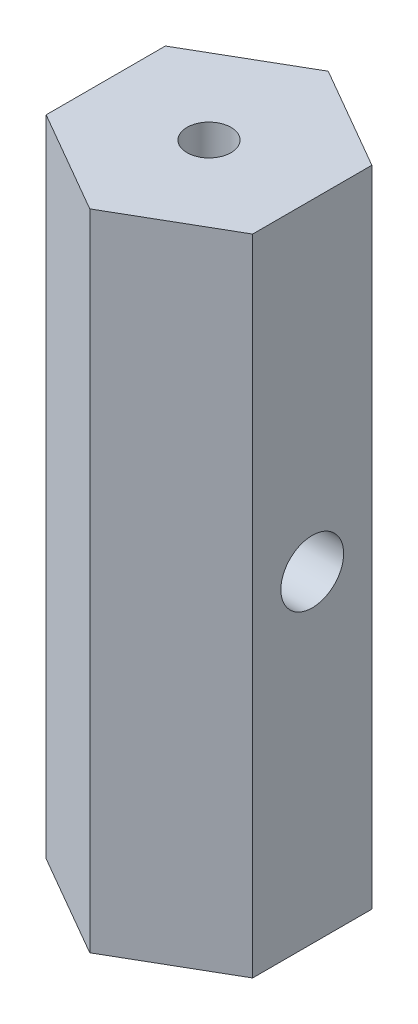
ISO-10303-21;
HEADER;
FILE_DESCRIPTION(('STEP AP214'),'2;1');
FILE_NAME('part.step','',(''),(''),'','','');
FILE_SCHEMA(('AUTOMOTIVE_DESIGN { 1 0 10303 214 1 1 1 1 }'));
ENDSEC;
DATA;
#1=APPLICATION_CONTEXT('core data for automotive mechanical design processes');
#2=APPLICATION_PROTOCOL_DEFINITION('international standard','automotive_design',2000,#1);
#3=PRODUCT_CONTEXT('',#1,'mechanical');
#4=PRODUCT('Part','Part','',(#3));
#5=PRODUCT_RELATED_PRODUCT_CATEGORY('part','',(#4));
#6=PRODUCT_DEFINITION_FORMATION('','',#4);
#7=PRODUCT_DEFINITION_CONTEXT('part definition',#1,'design');
#8=PRODUCT_DEFINITION('design','',#6,#7);
#9=PRODUCT_DEFINITION_SHAPE('','',#8);
#10=(LENGTH_UNIT() NAMED_UNIT(*) SI_UNIT(.MILLI.,.METRE.));
#11=(NAMED_UNIT(*) PLANE_ANGLE_UNIT() SI_UNIT($,.RADIAN.));
#12=(NAMED_UNIT(*) SI_UNIT($,.STERADIAN.) SOLID_ANGLE_UNIT());
#13=UNCERTAINTY_MEASURE_WITH_UNIT(LENGTH_MEASURE(1.E-05),#10,'distance_accuracy_value','');
#14=(GEOMETRIC_REPRESENTATION_CONTEXT(3) GLOBAL_UNCERTAINTY_ASSIGNED_CONTEXT((#13)) GLOBAL_UNIT_ASSIGNED_CONTEXT((#10,
#11,#12)) REPRESENTATION_CONTEXT('',''));
#15=CARTESIAN_POINT('',(0.,0.,0.));
#16=DIRECTION('',(0.,0.,1.));
#17=DIRECTION('',(1.,0.,0.));
#18=AXIS2_PLACEMENT_3D('',#15,#16,#17);
#19=CARTESIAN_POINT('',(6.35,19.812,-3.66617420935414));
#20=DIRECTION('',(-1.,0.,0.));
#21=DIRECTION('',(0.,0.,1.));
#22=AXIS2_PLACEMENT_3D('',#19,#20,#21);
#23=PLANE('',#22);
#24=DIRECTION('',(0.,-1.,0.));
#25=VECTOR('',#24,1.);
#26=CARTESIAN_POINT('',(6.35,19.812,3.6661742093541));
#27=LINE('',#26,#25);
#28=CARTESIAN_POINT('',(6.35,19.812,3.6661742093541));
#29=VERTEX_POINT('',#28);
#30=CARTESIAN_POINT('',(6.35,-19.812,3.6661742093541));
#31=VERTEX_POINT('',#30);
#32=EDGE_CURVE('E431',#29,#31,#27,.T.);
#33=ORIENTED_EDGE('',*,*,#32,.T.);
#34=DIRECTION('',(0.,0.,-1.));
#35=VECTOR('',#34,1.);
#36=CARTESIAN_POINT('',(6.35,-19.812,-3.66617420935414));
#37=LINE('',#36,#35);
#38=CARTESIAN_POINT('',(6.35,-19.812,-3.66617420935414));
#39=VERTEX_POINT('',#38);
#40=EDGE_CURVE('E424',#31,#39,#37,.T.);
#41=ORIENTED_EDGE('',*,*,#40,.T.);
#42=DIRECTION('',(0.,-1.,0.));
#43=VECTOR('',#42,1.);
#44=CARTESIAN_POINT('',(6.35,19.812,-3.66617420935414));
#45=LINE('',#44,#43);
#46=CARTESIAN_POINT('',(6.35,19.812,-3.66617420935414));
#47=VERTEX_POINT('',#46);
#48=EDGE_CURVE('E11',#47,#39,#45,.T.);
#49=ORIENTED_EDGE('',*,*,#48,.F.);
#50=DIRECTION('',(0.,0.,-1.));
#51=VECTOR('',#50,1.);
#52=CARTESIAN_POINT('',(6.35,19.812,-3.66617420935414));
#53=LINE('',#52,#51);
#54=EDGE_CURVE('E451',#29,#47,#53,.T.);
#55=ORIENTED_EDGE('',*,*,#54,.F.);
#56=EDGE_LOOP('',(#33,#41,#49,#55));
#57=FACE_BOUND('',#56,.T.);
#58=CARTESIAN_POINT('',(6.35,0.,0.));
#59=DIRECTION('',(-1.,0.,0.));
#60=DIRECTION('',(0.,0.,1.));
#61=AXIS2_PLACEMENT_3D('',#58,#59,#60);
#62=CIRCLE('',#61,1.9304);
#63=CARTESIAN_POINT('',(6.35,0.,1.9304));
#64=VERTEX_POINT('',#63);
#65=EDGE_CURVE('E435',#64,#64,#62,.T.);
#66=ORIENTED_EDGE('',*,*,#65,.T.);
#67=EDGE_LOOP('',(#66));
#68=FACE_BOUND('',#67,.T.);
#69=ADVANCED_FACE('F360',(#57,#68),#23,.F.);
#70=CARTESIAN_POINT('',(-6.35,19.812,3.66617420935413));
#71=DIRECTION('',(1.,0.,0.));
#72=DIRECTION('',(0.,0.,-1.));
#73=AXIS2_PLACEMENT_3D('',#70,#71,#72);
#74=PLANE('',#73);
#75=DIRECTION('',(0.,-1.,0.));
#76=VECTOR('',#75,1.);
#77=CARTESIAN_POINT('',(-6.35,19.812,-3.6661742093541));
#78=LINE('',#77,#76);
#79=CARTESIAN_POINT('',(-6.35,19.812,-3.6661742093541));
#80=VERTEX_POINT('',#79);
#81=CARTESIAN_POINT('',(-6.35,-19.812,-3.6661742093541));
#82=VERTEX_POINT('',#81);
#83=EDGE_CURVE('E465',#80,#82,#78,.T.);
#84=ORIENTED_EDGE('',*,*,#83,.T.);
#85=DIRECTION('',(0.,0.,1.));
#86=VECTOR('',#85,1.);
#87=CARTESIAN_POINT('',(-6.35,-19.812,3.66617420935413));
#88=LINE('',#87,#86);
#89=CARTESIAN_POINT('',(-6.35,-19.812,3.66617420935413));
#90=VERTEX_POINT('',#89);
#91=EDGE_CURVE('E440',#82,#90,#88,.T.);
#92=ORIENTED_EDGE('',*,*,#91,.T.);
#93=DIRECTION('',(0.,-1.,0.));
#94=VECTOR('',#93,1.);
#95=CARTESIAN_POINT('',(-6.35,19.812,3.66617420935413));
#96=LINE('',#95,#94);
#97=CARTESIAN_POINT('',(-6.35,19.812,3.66617420935413));
#98=VERTEX_POINT('',#97);
#99=EDGE_CURVE('E463',#98,#90,#96,.T.);
#100=ORIENTED_EDGE('',*,*,#99,.F.);
#101=DIRECTION('',(0.,0.,1.));
#102=VECTOR('',#101,1.);
#103=CARTESIAN_POINT('',(-6.35,19.812,3.66617420935413));
#104=LINE('',#103,#102);
#105=EDGE_CURVE('E456',#80,#98,#104,.T.);
#106=ORIENTED_EDGE('',*,*,#105,.F.);
#107=EDGE_LOOP('',(#84,#92,#100,#106));
#108=FACE_BOUND('',#107,.T.);
#109=CARTESIAN_POINT('',(-6.35,0.,0.));
#110=DIRECTION('',(1.,0.,0.));
#111=DIRECTION('',(0.,0.,-1.));
#112=AXIS2_PLACEMENT_3D('',#109,#110,#111);
#113=CIRCLE('',#112,1.9304);
#114=CARTESIAN_POINT('',(-6.35,0.,-1.9304));
#115=VERTEX_POINT('',#114);
#116=EDGE_CURVE('E538',#115,#115,#113,.F.);
#117=ORIENTED_EDGE('',*,*,#116,.F.);
#118=EDGE_LOOP('',(#117));
#119=FACE_BOUND('',#118,.T.);
#120=ADVANCED_FACE('F475',(#108,#119),#74,.F.);
#121=CARTESIAN_POINT('',(0.,19.812,0.));
#122=DIRECTION('',(0.,-1.,0.));
#123=DIRECTION('',(0.,0.,-1.));
#124=AXIS2_PLACEMENT_3D('',#121,#122,#123);
#125=CYLINDRICAL_SURFACE('',#124,1.35255);
#126=CARTESIAN_POINT('',(0.,19.812,0.));
#127=DIRECTION('',(0.,1.,0.));
#128=DIRECTION('',(0.,0.,1.));
#129=AXIS2_PLACEMENT_3D('',#126,#127,#128);
#130=CIRCLE('',#129,1.35255);
#131=CARTESIAN_POINT('',(0.,19.812,1.35255));
#132=VERTEX_POINT('',#131);
#133=EDGE_CURVE('E448',#132,#132,#130,.T.);
#134=ORIENTED_EDGE('',*,*,#133,.T.);
#135=EDGE_LOOP('',(#134));
#136=FACE_BOUND('',#135,.T.);
#137=CARTESIAN_POINT('',(0.,1.37733534678378,1.35255));
#138=CARTESIAN_POINT('',(0.0648530201230944,1.3773493670669,1.35254243943125));
#139=CARTESIAN_POINT('',(0.129780067415963,1.38201412803462,1.34783546147366));
#140=CARTESIAN_POINT('',(0.257220367390132,1.3997083119165,1.32943867824006));
#141=CARTESIAN_POINT('',(0.319726798695202,1.41275977426448,1.3157252026653));
#142=CARTESIAN_POINT('',(0.440004051467046,1.444756877397,1.28049810005175));
#143=CARTESIAN_POINT('',(0.497820185354885,1.46363465387409,1.25907383318285));
#144=CARTESIAN_POINT('',(0.608900886604142,1.50504218280734,1.20927267395562));
#145=CARTESIAN_POINT('',(0.662165232520626,1.52757211278684,1.18089544359436));
#146=CARTESIAN_POINT('',(0.77287154796563,1.5784666998126,1.11221297911975));
#147=CARTESIAN_POINT('',(0.829405401996451,1.60716131922975,1.07068830685041));
#148=CARTESIAN_POINT('',(0.935513590952789,1.66440553656818,0.979342659839463));
#149=CARTESIAN_POINT('',(0.985079291530672,1.69295491304685,0.929511556617716));
#150=CARTESIAN_POINT('',(1.08409066113262,1.75227909781525,0.812969463626391));
#151=CARTESIAN_POINT('',(1.13213395846953,1.78262934465692,0.74482927260273));
#152=CARTESIAN_POINT('',(1.21561124436246,1.83677919202623,0.598918701424468));
#153=CARTESIAN_POINT('',(1.25107040880123,1.86059184981974,0.521167973402441));
#154=CARTESIAN_POINT('',(1.29951310617903,1.8935595210145,0.380288016910429));
#155=CARTESIAN_POINT('',(1.31597856596714,1.90493533273098,0.318866584212294));
#156=CARTESIAN_POINT('',(1.34014765452286,1.92171034368025,0.193539042561926));
#157=CARTESIAN_POINT('',(1.34785831940531,1.9271143422881,0.129634971657513));
#158=CARTESIAN_POINT('',(1.35408398534359,1.93147385140685,0.00103181692961999));
#159=CARTESIAN_POINT('',(1.35258105852806,1.93041678995358,-0.0636685722211663));
#160=CARTESIAN_POINT('',(1.34043050510259,1.92192300713964,-0.19178148043198));
#161=CARTESIAN_POINT('',(1.32978028818574,1.91448447869167,-0.255193629484147));
#162=CARTESIAN_POINT('',(1.30027959112502,1.89411440980424,-0.377540892878191));
#163=CARTESIAN_POINT('',(1.2816230001869,1.88131290806232,-0.436545370906456));
#164=CARTESIAN_POINT('',(1.2369860508601,1.85119324493214,-0.550457394819342));
#165=CARTESIAN_POINT('',(1.21100432750098,1.83387424179446,-0.605364174722015));
#166=CARTESIAN_POINT('',(1.14930157000408,1.79369352514085,-0.716213633852722));
#167=CARTESIAN_POINT('',(1.11281481729921,1.77042792548807,-0.771581190717357));
#168=CARTESIAN_POINT('',(1.03284657381608,1.72128704500897,-0.875750961197346));
#169=CARTESIAN_POINT('',(0.989357494532009,1.69540894446291,-0.924545945466577));
#170=CARTESIAN_POINT('',(0.887783223398761,1.63803025134626,-1.02328508213962));
#171=CARTESIAN_POINT('',(0.828478559465468,1.60635163263059,-1.07187490540144));
#172=CARTESIAN_POINT('',(0.701831877518403,1.54484824419096,-1.15875639030497));
#173=CARTESIAN_POINT('',(0.634490860552309,1.51502324427353,-1.19704933264764));
#174=CARTESIAN_POINT('',(0.508748072352289,1.4674206328911,-1.25466382566595));
#175=CARTESIAN_POINT('',(0.451873463016482,1.44845146846668,-1.27632434545355));
#176=CARTESIAN_POINT('',(0.334312686839316,1.41621240415852,-1.3120105417583));
#177=CARTESIAN_POINT('',(0.273638947361314,1.4029249317858,-1.32605979512635));
#178=CARTESIAN_POINT('',(0.176989245101606,1.38823352162447,-1.34138282780334));
#179=CARTESIAN_POINT('',(0.141854397787233,1.38417356213129,-1.34555730345349));
#180=CARTESIAN_POINT('',(0.0711538419268254,1.37872041888116,-1.3511431805462));
#181=CARTESIAN_POINT('',(0.0355880667194112,1.37732765315949,-1.35255414885883));
#182=CARTESIAN_POINT('',(-0.0648530201230945,1.3773493670669,-1.35254243943125));
#183=CARTESIAN_POINT('',(-0.129780067415963,1.38201412803462,-1.34783546147366));
#184=CARTESIAN_POINT('',(-0.257220367390132,1.3997083119165,-1.32943867824006));
#185=CARTESIAN_POINT('',(-0.319726798695201,1.41275977426448,-1.3157252026653));
#186=CARTESIAN_POINT('',(-0.440004051467046,1.444756877397,-1.28049810005175));
#187=CARTESIAN_POINT('',(-0.497820185354885,1.46363465387409,-1.25907383318285));
#188=CARTESIAN_POINT('',(-0.608900886604141,1.50504218280734,-1.20927267395562));
#189=CARTESIAN_POINT('',(-0.662165232520626,1.52757211278684,-1.18089544359436));
#190=CARTESIAN_POINT('',(-0.772871547965629,1.5784666998126,-1.11221297911975));
#191=CARTESIAN_POINT('',(-0.82940540199645,1.60716131922975,-1.07068830685041));
#192=CARTESIAN_POINT('',(-0.935513590952789,1.66440553656818,-0.979342659839463));
#193=CARTESIAN_POINT('',(-0.985079291530671,1.69295491304685,-0.929511556617716));
#194=CARTESIAN_POINT('',(-1.08409066113262,1.75227909781525,-0.812969463626391));
#195=CARTESIAN_POINT('',(-1.13213395846953,1.78262934465692,-0.74482927260273));
#196=CARTESIAN_POINT('',(-1.21561124436246,1.83677919202623,-0.598918701424468));
#197=CARTESIAN_POINT('',(-1.25107040880123,1.86059184981974,-0.521167973402441));
#198=CARTESIAN_POINT('',(-1.29951310617903,1.8935595210145,-0.380288016910429));
#199=CARTESIAN_POINT('',(-1.31597856596714,1.90493533273098,-0.318866584212295));
#200=CARTESIAN_POINT('',(-1.34014765452286,1.92171034368025,-0.193539042561927));
#201=CARTESIAN_POINT('',(-1.34785831940531,1.9271143422881,-0.129634971657513));
#202=CARTESIAN_POINT('',(-1.35408398534359,1.93147385140685,-0.00103181692962011));
#203=CARTESIAN_POINT('',(-1.35258105852806,1.93041678995358,0.063668572221166));
#204=CARTESIAN_POINT('',(-1.34043050510259,1.92192300713964,0.19178148043198));
#205=CARTESIAN_POINT('',(-1.32978028818574,1.91448447869167,0.255193629484147));
#206=CARTESIAN_POINT('',(-1.30027959112502,1.89411440980424,0.377540892878191));
#207=CARTESIAN_POINT('',(-1.2816230001869,1.88131290806232,0.436545370906456));
#208=CARTESIAN_POINT('',(-1.2369860508601,1.85119324493214,0.550457394819342));
#209=CARTESIAN_POINT('',(-1.21100432750098,1.83387424179446,0.605364174722015));
#210=CARTESIAN_POINT('',(-1.14930157000408,1.79369352514085,0.716213633852721));
#211=CARTESIAN_POINT('',(-1.11281481729921,1.77042792548807,0.771581190717357));
#212=CARTESIAN_POINT('',(-1.03284657381609,1.72128704500897,0.875750961197346));
#213=CARTESIAN_POINT('',(-0.989357494532009,1.69540894446291,0.924545945466577));
#214=CARTESIAN_POINT('',(-0.887783223398761,1.63803025134626,1.02328508213962));
#215=CARTESIAN_POINT('',(-0.828478559465468,1.60635163263059,1.07187490540144));
#216=CARTESIAN_POINT('',(-0.701831877518403,1.54484824419096,1.15875639030497));
#217=CARTESIAN_POINT('',(-0.634490860552309,1.51502324427353,1.19704933264764));
#218=CARTESIAN_POINT('',(-0.508748072352289,1.4674206328911,1.25466382566595));
#219=CARTESIAN_POINT('',(-0.451873463016483,1.44845146846668,1.27632434545355));
#220=CARTESIAN_POINT('',(-0.334312686839317,1.41621240415852,1.3120105417583));
#221=CARTESIAN_POINT('',(-0.273638947361314,1.40292493178579,1.32605979512635));
#222=CARTESIAN_POINT('',(-0.176989245101606,1.38823352162447,1.34138282780334));
#223=CARTESIAN_POINT('',(-0.141854397787233,1.38417356213129,1.34555730345349));
#224=CARTESIAN_POINT('',(-0.0711538419268252,1.37872041888116,1.3511431805462));
#225=CARTESIAN_POINT('',(-0.0355880667194111,1.37732765315949,1.35255414885883));
#226=CARTESIAN_POINT('',(0.,1.37733534678378,1.35255));
#227=B_SPLINE_CURVE_WITH_KNOTS('',3,(#137,#138,#139,#140,#141,#142,#143,#144,#145,#146,#147,
#148,#149,#150,#151,#152,#153,#154,#155,#156,#157,#158,#159,#160,#161,#162,#163,#164,#165,#166,
#167,#168,#169,#170,#171,#172,#173,#174,#175,#176,#177,#178,#179,#180,#181,#182,#183,#184,#185,
#186,#187,#188,#189,#190,#191,#192,#193,#194,#195,#196,#197,#198,#199,#200,#201,#202,#203,#204,
#205,#206,#207,#208,#209,#210,#211,#212,#213,#214,#215,#216,#217,#218,#219,#220,#221,#222,#223,
#224,#225,#226),.UNSPECIFIED.,.T.,.F.,(4,2,2,2,2,2,2,2,2,2,2,2,2,2,2,2,2,2,2,2,2,2,2,2,2,2,2,2,
2,2,2,2,2,2,2,2,2,2,2,2,2,2,2,2,4),(0.,0.19438548219122,0.389283891215313,0.581992749258649,
0.774710977275919,1.00126098615992,1.22808928801112,1.49279776111969,1.75697363140646,
1.94994214846621,2.14275546921798,2.33594408640785,2.52918742831489,2.71799397477596,
2.90683572686442,3.11686782595426,3.3271290905984,3.57498316124378,3.82280639012956,
4.01339649790976,4.20339280337691,4.31004503810804,4.4167139873162,4.61109946950742,
4.80599787853152,4.99870673657485,5.19142496459212,5.41797497347612,5.64480327532732,
5.90951174843589,6.17368761872267,6.36665613578241,6.55946945653418,6.75265807372405,
6.94590141563109,7.13470796209216,7.32354971418062,7.53358181327046,7.7438430779146,
7.99169714855998,8.23952037744576,8.43011048522597,8.62010679069311,8.72675902542425,
8.83342797463241),.UNSPECIFIED.);
#228=CARTESIAN_POINT('',(0.,1.37733534678378,1.35255));
#229=VERTEX_POINT('',#228);
#230=EDGE_CURVE('E523',#229,#229,#227,.T.);
#231=ORIENTED_EDGE('',*,*,#230,.F.);
#232=EDGE_LOOP('',(#231));
#233=FACE_BOUND('',#232,.T.);
#234=ADVANCED_FACE('F497',(#136,#233),#125,.F.);
#235=CARTESIAN_POINT('',(0.,-19.812,0.));
#236=DIRECTION('',(0.,1.,0.));
#237=DIRECTION('',(0.,0.,1.));
#238=AXIS2_PLACEMENT_3D('',#235,#236,#237);
#239=CIRCLE('',#238,1.35255);
#240=CARTESIAN_POINT('',(0.,-19.812,1.35255));
#241=VERTEX_POINT('',#240);
#242=EDGE_CURVE('E432',#241,#241,#239,.T.);
#243=ORIENTED_EDGE('',*,*,#242,.F.);
#244=EDGE_LOOP('',(#243));
#245=FACE_BOUND('',#244,.T.);
#246=CARTESIAN_POINT('',(0.,-1.37733534678378,-1.35255));
#247=CARTESIAN_POINT('',(0.0648530201230944,-1.3773493670669,-1.35254243943125));
#248=CARTESIAN_POINT('',(0.129780067415963,-1.38201412803462,-1.34783546147366));
#249=CARTESIAN_POINT('',(0.257220367390132,-1.3997083119165,-1.32943867824006));
#250=CARTESIAN_POINT('',(0.319726798695202,-1.41275977426448,-1.3157252026653));
#251=CARTESIAN_POINT('',(0.440004051467046,-1.444756877397,-1.28049810005175));
#252=CARTESIAN_POINT('',(0.497820185354885,-1.46363465387409,-1.25907383318285));
#253=CARTESIAN_POINT('',(0.608900886604142,-1.50504218280734,-1.20927267395562));
#254=CARTESIAN_POINT('',(0.662165232520626,-1.52757211278684,-1.18089544359436));
#255=CARTESIAN_POINT('',(0.77287154796563,-1.5784666998126,-1.11221297911975));
#256=CARTESIAN_POINT('',(0.829405401996451,-1.60716131922975,-1.07068830685041));
#257=CARTESIAN_POINT('',(0.935513590952789,-1.66440553656818,-0.979342659839463));
#258=CARTESIAN_POINT('',(0.985079291530672,-1.69295491304685,-0.929511556617716));
#259=CARTESIAN_POINT('',(1.08409066113262,-1.75227909781525,-0.812969463626391));
#260=CARTESIAN_POINT('',(1.13213395846953,-1.78262934465692,-0.74482927260273));
#261=CARTESIAN_POINT('',(1.21561124436246,-1.83677919202623,-0.598918701424468));
#262=CARTESIAN_POINT('',(1.25107040880123,-1.86059184981974,-0.521167973402441));
#263=CARTESIAN_POINT('',(1.29951310617903,-1.8935595210145,-0.380288016910429));
#264=CARTESIAN_POINT('',(1.31597856596714,-1.90493533273098,-0.318866584212294));
#265=CARTESIAN_POINT('',(1.34014765452286,-1.92171034368025,-0.193539042561926));
#266=CARTESIAN_POINT('',(1.34785831940531,-1.9271143422881,-0.129634971657513));
#267=CARTESIAN_POINT('',(1.35408398534359,-1.93147385140685,-0.00103181692961999));
#268=CARTESIAN_POINT('',(1.35258105852806,-1.93041678995358,0.0636685722211663));
#269=CARTESIAN_POINT('',(1.34043050510259,-1.92192300713964,0.19178148043198));
#270=CARTESIAN_POINT('',(1.32978028818574,-1.91448447869167,0.255193629484147));
#271=CARTESIAN_POINT('',(1.30027959112502,-1.89411440980424,0.377540892878191));
#272=CARTESIAN_POINT('',(1.2816230001869,-1.88131290806232,0.436545370906456));
#273=CARTESIAN_POINT('',(1.2369860508601,-1.85119324493214,0.550457394819342));
#274=CARTESIAN_POINT('',(1.21100432750098,-1.83387424179446,0.605364174722015));
#275=CARTESIAN_POINT('',(1.14930157000408,-1.79369352514085,0.716213633852722));
#276=CARTESIAN_POINT('',(1.11281481729921,-1.77042792548807,0.771581190717357));
#277=CARTESIAN_POINT('',(1.03284657381608,-1.72128704500897,0.875750961197346));
#278=CARTESIAN_POINT('',(0.989357494532009,-1.69540894446291,0.924545945466577));
#279=CARTESIAN_POINT('',(0.887783223398761,-1.63803025134626,1.02328508213962));
#280=CARTESIAN_POINT('',(0.828478559465468,-1.60635163263059,1.07187490540144));
#281=CARTESIAN_POINT('',(0.701831877518403,-1.54484824419096,1.15875639030497));
#282=CARTESIAN_POINT('',(0.634490860552309,-1.51502324427353,1.19704933264764));
#283=CARTESIAN_POINT('',(0.508748072352289,-1.4674206328911,1.25466382566595));
#284=CARTESIAN_POINT('',(0.451873463016482,-1.44845146846668,1.27632434545355));
#285=CARTESIAN_POINT('',(0.334312686839316,-1.41621240415852,1.3120105417583));
#286=CARTESIAN_POINT('',(0.273638947361314,-1.4029249317858,1.32605979512635));
#287=CARTESIAN_POINT('',(0.176989245101606,-1.38823352162447,1.34138282780334));
#288=CARTESIAN_POINT('',(0.141854397787233,-1.38417356213129,1.34555730345349));
#289=CARTESIAN_POINT('',(0.0711538419268254,-1.37872041888116,1.3511431805462));
#290=CARTESIAN_POINT('',(0.0355880667194112,-1.37732765315949,1.35255414885883));
#291=CARTESIAN_POINT('',(-0.0648530201230945,-1.3773493670669,1.35254243943125));
#292=CARTESIAN_POINT('',(-0.129780067415963,-1.38201412803462,1.34783546147366));
#293=CARTESIAN_POINT('',(-0.257220367390132,-1.3997083119165,1.32943867824006));
#294=CARTESIAN_POINT('',(-0.319726798695201,-1.41275977426448,1.3157252026653));
#295=CARTESIAN_POINT('',(-0.440004051467046,-1.444756877397,1.28049810005175));
#296=CARTESIAN_POINT('',(-0.497820185354885,-1.46363465387409,1.25907383318285));
#297=CARTESIAN_POINT('',(-0.608900886604141,-1.50504218280734,1.20927267395562));
#298=CARTESIAN_POINT('',(-0.662165232520626,-1.52757211278684,1.18089544359436));
#299=CARTESIAN_POINT('',(-0.772871547965629,-1.5784666998126,1.11221297911975));
#300=CARTESIAN_POINT('',(-0.82940540199645,-1.60716131922975,1.07068830685041));
#301=CARTESIAN_POINT('',(-0.935513590952789,-1.66440553656818,0.979342659839463));
#302=CARTESIAN_POINT('',(-0.985079291530671,-1.69295491304685,0.929511556617716));
#303=CARTESIAN_POINT('',(-1.08409066113262,-1.75227909781525,0.812969463626391));
#304=CARTESIAN_POINT('',(-1.13213395846953,-1.78262934465692,0.74482927260273));
#305=CARTESIAN_POINT('',(-1.21561124436246,-1.83677919202623,0.598918701424468));
#306=CARTESIAN_POINT('',(-1.25107040880123,-1.86059184981974,0.521167973402441));
#307=CARTESIAN_POINT('',(-1.29951310617903,-1.8935595210145,0.380288016910429));
#308=CARTESIAN_POINT('',(-1.31597856596714,-1.90493533273098,0.318866584212295));
#309=CARTESIAN_POINT('',(-1.34014765452286,-1.92171034368025,0.193539042561927));
#310=CARTESIAN_POINT('',(-1.34785831940531,-1.9271143422881,0.129634971657513));
#311=CARTESIAN_POINT('',(-1.35408398534359,-1.93147385140685,0.00103181692962011));
#312=CARTESIAN_POINT('',(-1.35258105852806,-1.93041678995358,-0.063668572221166));
#313=CARTESIAN_POINT('',(-1.34043050510259,-1.92192300713964,-0.19178148043198));
#314=CARTESIAN_POINT('',(-1.32978028818574,-1.91448447869167,-0.255193629484147));
#315=CARTESIAN_POINT('',(-1.30027959112502,-1.89411440980424,-0.377540892878191));
#316=CARTESIAN_POINT('',(-1.2816230001869,-1.88131290806232,-0.436545370906456));
#317=CARTESIAN_POINT('',(-1.2369860508601,-1.85119324493214,-0.550457394819342));
#318=CARTESIAN_POINT('',(-1.21100432750098,-1.83387424179446,-0.605364174722015));
#319=CARTESIAN_POINT('',(-1.14930157000408,-1.79369352514085,-0.716213633852721));
#320=CARTESIAN_POINT('',(-1.11281481729921,-1.77042792548807,-0.771581190717357));
#321=CARTESIAN_POINT('',(-1.03284657381609,-1.72128704500897,-0.875750961197346));
#322=CARTESIAN_POINT('',(-0.989357494532009,-1.69540894446291,-0.924545945466577));
#323=CARTESIAN_POINT('',(-0.887783223398761,-1.63803025134626,-1.02328508213962));
#324=CARTESIAN_POINT('',(-0.828478559465468,-1.60635163263059,-1.07187490540144));
#325=CARTESIAN_POINT('',(-0.701831877518403,-1.54484824419096,-1.15875639030497));
#326=CARTESIAN_POINT('',(-0.634490860552309,-1.51502324427353,-1.19704933264764));
#327=CARTESIAN_POINT('',(-0.508748072352289,-1.4674206328911,-1.25466382566595));
#328=CARTESIAN_POINT('',(-0.451873463016483,-1.44845146846668,-1.27632434545355));
#329=CARTESIAN_POINT('',(-0.334312686839317,-1.41621240415852,-1.3120105417583));
#330=CARTESIAN_POINT('',(-0.273638947361314,-1.40292493178579,-1.32605979512635));
#331=CARTESIAN_POINT('',(-0.176989245101606,-1.38823352162447,-1.34138282780334));
#332=CARTESIAN_POINT('',(-0.141854397787233,-1.38417356213129,-1.34555730345349));
#333=CARTESIAN_POINT('',(-0.0711538419268252,-1.37872041888116,-1.3511431805462));
#334=CARTESIAN_POINT('',(-0.0355880667194111,-1.37732765315949,-1.35255414885883));
#335=CARTESIAN_POINT('',(0.,-1.37733534678378,-1.35255));
#336=B_SPLINE_CURVE_WITH_KNOTS('',3,(#246,#247,#248,#249,#250,#251,#252,#253,#254,#255,#256,
#257,#258,#259,#260,#261,#262,#263,#264,#265,#266,#267,#268,#269,#270,#271,#272,#273,#274,#275,
#276,#277,#278,#279,#280,#281,#282,#283,#284,#285,#286,#287,#288,#289,#290,#291,#292,#293,#294,
#295,#296,#297,#298,#299,#300,#301,#302,#303,#304,#305,#306,#307,#308,#309,#310,#311,#312,#313,
#314,#315,#316,#317,#318,#319,#320,#321,#322,#323,#324,#325,#326,#327,#328,#329,#330,#331,#332,
#333,#334,#335),.UNSPECIFIED.,.T.,.F.,(4,2,2,2,2,2,2,2,2,2,2,2,2,2,2,2,2,2,2,2,2,2,2,2,2,2,2,2,
2,2,2,2,2,2,2,2,2,2,2,2,2,2,2,2,4),(0.,0.19438548219122,0.389283891215313,0.581992749258649,
0.774710977275919,1.00126098615992,1.22808928801112,1.49279776111969,1.75697363140646,
1.94994214846621,2.14275546921798,2.33594408640785,2.52918742831489,2.71799397477596,
2.90683572686442,3.11686782595426,3.3271290905984,3.57498316124378,3.82280639012956,
4.01339649790976,4.20339280337691,4.31004503810804,4.4167139873162,4.61109946950742,
4.80599787853152,4.99870673657485,5.19142496459212,5.41797497347612,5.64480327532732,
5.90951174843589,6.17368761872267,6.36665613578241,6.55946945653418,6.75265807372405,
6.94590141563109,7.13470796209216,7.32354971418062,7.53358181327046,7.7438430779146,
7.99169714855998,8.23952037744576,8.43011048522597,8.62010679069311,8.72675902542425,
8.83342797463241),.UNSPECIFIED.);
#337=CARTESIAN_POINT('',(0.,-1.37733534678378,-1.35255));
#338=VERTEX_POINT('',#337);
#339=EDGE_CURVE('E528',#338,#338,#336,.T.);
#340=ORIENTED_EDGE('',*,*,#339,.F.);
#341=EDGE_LOOP('',(#340));
#342=FACE_BOUND('',#341,.T.);
#343=ADVANCED_FACE('F502',(#245,#342),#125,.F.);
#344=CARTESIAN_POINT('',(6.35,19.812,-3.66617420935414));
#345=DIRECTION('',(0.,1.,0.));
#346=DIRECTION('',(0.,0.,1.));
#347=AXIS2_PLACEMENT_3D('',#344,#345,#346);
#348=PLANE('',#347);
#349=ORIENTED_EDGE('',*,*,#54,.T.);
#350=DIRECTION('',(-0.86602540378444,0.,-0.499999999999997));
#351=VECTOR('',#350,1.);
#352=CARTESIAN_POINT('',(0.,19.812,-7.33234841870825));
#353=LINE('',#352,#351);
#354=CARTESIAN_POINT('',(0.,19.812,-7.33234841870825));
#355=VERTEX_POINT('',#354);
#356=EDGE_CURVE('E415',#47,#355,#353,.T.);
#357=ORIENTED_EDGE('',*,*,#356,.T.);
#358=DIRECTION('',(-0.866025403784436,0.,0.500000000000005));
#359=VECTOR('',#358,1.);
#360=CARTESIAN_POINT('',(-6.35,19.812,-3.6661742093541));
#361=LINE('',#360,#359);
#362=EDGE_CURVE('E454',#355,#80,#361,.T.);
#363=ORIENTED_EDGE('',*,*,#362,.T.);
#364=ORIENTED_EDGE('',*,*,#105,.T.);
#365=DIRECTION('',(0.86602540378444,0.,0.499999999999998));
#366=VECTOR('',#365,1.);
#367=CARTESIAN_POINT('',(0.,19.812,7.33234841870825));
#368=LINE('',#367,#366);
#369=CARTESIAN_POINT('',(0.,19.812,7.33234841870825));
#370=VERTEX_POINT('',#369);
#371=EDGE_CURVE('E379',#98,#370,#368,.T.);
#372=ORIENTED_EDGE('',*,*,#371,.T.);
#373=DIRECTION('',(0.866025403784436,0.,-0.500000000000004));
#374=VECTOR('',#373,1.);
#375=CARTESIAN_POINT('',(6.35,19.812,3.6661742093541));
#376=LINE('',#375,#374);
#377=EDGE_CURVE('E374',#370,#29,#376,.T.);
#378=ORIENTED_EDGE('',*,*,#377,.T.);
#379=EDGE_LOOP('',(#349,#357,#363,#364,#372,#378));
#380=FACE_BOUND('',#379,.T.);
#381=ORIENTED_EDGE('',*,*,#133,.F.);
#382=EDGE_LOOP('',(#381));
#383=FACE_BOUND('',#382,.T.);
#384=ADVANCED_FACE('F471',(#380,#383),#348,.T.);
#385=CARTESIAN_POINT('',(0.,19.812,-7.33234841870825));
#386=DIRECTION('',(-0.499999999999997,0.,0.86602540378444));
#387=DIRECTION('',(0.86602540378444,0.,0.499999999999997));
#388=AXIS2_PLACEMENT_3D('',#385,#386,#387);
#389=PLANE('',#388);
#390=ORIENTED_EDGE('',*,*,#48,.T.);
#391=DIRECTION('',(-0.86602540378444,0.,-0.499999999999997));
#392=VECTOR('',#391,1.);
#393=CARTESIAN_POINT('',(0.,-19.812,-7.33234841870825));
#394=LINE('',#393,#392);
#395=CARTESIAN_POINT('',(0.,-19.812,-7.33234841870825));
#396=VERTEX_POINT('',#395);
#397=EDGE_CURVE('E414',#39,#396,#394,.T.);
#398=ORIENTED_EDGE('',*,*,#397,.T.);
#399=DIRECTION('',(0.,-1.,0.));
#400=VECTOR('',#399,1.);
#401=CARTESIAN_POINT('',(0.,19.812,-7.33234841870825));
#402=LINE('',#401,#400);
#403=EDGE_CURVE('E367',#355,#396,#402,.T.);
#404=ORIENTED_EDGE('',*,*,#403,.F.);
#405=ORIENTED_EDGE('',*,*,#356,.F.);
#406=EDGE_LOOP('',(#390,#398,#404,#405));
#407=FACE_BOUND('',#406,.T.);
#408=ADVANCED_FACE('F412',(#407),#389,.F.);
#409=CARTESIAN_POINT('',(-6.35,19.812,-3.6661742093541));
#410=DIRECTION('',(0.500000000000005,0.,0.866025403784436));
#411=DIRECTION('',(0.866025403784436,0.,-0.500000000000005));
#412=AXIS2_PLACEMENT_3D('',#409,#410,#411);
#413=PLANE('',#412);
#414=ORIENTED_EDGE('',*,*,#403,.T.);
#415=DIRECTION('',(-0.866025403784436,0.,0.500000000000005));
#416=VECTOR('',#415,1.);
#417=CARTESIAN_POINT('',(-6.35,-19.812,-3.6661742093541));
#418=LINE('',#417,#416);
#419=EDGE_CURVE('E428',#396,#82,#418,.T.);
#420=ORIENTED_EDGE('',*,*,#419,.T.);
#421=ORIENTED_EDGE('',*,*,#83,.F.);
#422=ORIENTED_EDGE('',*,*,#362,.F.);
#423=EDGE_LOOP('',(#414,#420,#421,#422));
#424=FACE_BOUND('',#423,.T.);
#425=ADVANCED_FACE('F468',(#424),#413,.F.);
#426=CARTESIAN_POINT('',(0.,19.812,7.33234841870825));
#427=DIRECTION('',(0.499999999999998,0.,-0.86602540378444));
#428=DIRECTION('',(-0.86602540378444,0.,-0.499999999999998));
#429=AXIS2_PLACEMENT_3D('',#426,#427,#428);
#430=PLANE('',#429);
#431=ORIENTED_EDGE('',*,*,#99,.T.);
#432=DIRECTION('',(0.86602540378444,0.,0.499999999999998));
#433=VECTOR('',#432,1.);
#434=CARTESIAN_POINT('',(0.,-19.812,7.33234841870825));
#435=LINE('',#434,#433);
#436=CARTESIAN_POINT('',(0.,-19.812,7.33234841870825));
#437=VERTEX_POINT('',#436);
#438=EDGE_CURVE('E443',#90,#437,#435,.T.);
#439=ORIENTED_EDGE('',*,*,#438,.T.);
#440=DIRECTION('',(0.,-1.,0.));
#441=VECTOR('',#440,1.);
#442=CARTESIAN_POINT('',(0.,19.812,7.33234841870825));
#443=LINE('',#442,#441);
#444=EDGE_CURVE('E461',#370,#437,#443,.T.);
#445=ORIENTED_EDGE('',*,*,#444,.F.);
#446=ORIENTED_EDGE('',*,*,#371,.F.);
#447=EDGE_LOOP('',(#431,#439,#445,#446));
#448=FACE_BOUND('',#447,.T.);
#449=ADVANCED_FACE('F479',(#448),#430,.F.);
#450=CARTESIAN_POINT('',(6.35,19.812,3.6661742093541));
#451=DIRECTION('',(-0.500000000000004,0.,-0.866025403784436));
#452=DIRECTION('',(-0.866025403784436,0.,0.500000000000004));
#453=AXIS2_PLACEMENT_3D('',#450,#451,#452);
#454=PLANE('',#453);
#455=ORIENTED_EDGE('',*,*,#444,.T.);
#456=DIRECTION('',(0.866025403784436,0.,-0.500000000000004));
#457=VECTOR('',#456,1.);
#458=CARTESIAN_POINT('',(6.35,-19.812,3.6661742093541));
#459=LINE('',#458,#457);
#460=EDGE_CURVE('E446',#437,#31,#459,.T.);
#461=ORIENTED_EDGE('',*,*,#460,.T.);
#462=ORIENTED_EDGE('',*,*,#32,.F.);
#463=ORIENTED_EDGE('',*,*,#377,.F.);
#464=EDGE_LOOP('',(#455,#461,#462,#463));
#465=FACE_BOUND('',#464,.T.);
#466=ADVANCED_FACE('F481',(#465),#454,.F.);
#467=CARTESIAN_POINT('',(6.35,-19.812,-3.66617420935414));
#468=DIRECTION('',(0.,1.,0.));
#469=DIRECTION('',(0.,0.,1.));
#470=AXIS2_PLACEMENT_3D('',#467,#468,#469);
#471=PLANE('',#470);
#472=ORIENTED_EDGE('',*,*,#242,.T.);
#473=EDGE_LOOP('',(#472));
#474=FACE_BOUND('',#473,.T.);
#475=ORIENTED_EDGE('',*,*,#40,.F.);
#476=ORIENTED_EDGE('',*,*,#460,.F.);
#477=ORIENTED_EDGE('',*,*,#438,.F.);
#478=ORIENTED_EDGE('',*,*,#91,.F.);
#479=ORIENTED_EDGE('',*,*,#419,.F.);
#480=ORIENTED_EDGE('',*,*,#397,.F.);
#481=EDGE_LOOP('',(#475,#476,#477,#478,#479,#480));
#482=FACE_BOUND('',#481,.T.);
#483=ADVANCED_FACE('F422',(#474,#482),#471,.F.);
#484=CARTESIAN_POINT('',(6.351,0.,0.));
#485=DIRECTION('',(-1.,0.,0.));
#486=DIRECTION('',(0.,0.,1.));
#487=AXIS2_PLACEMENT_3D('',#484,#485,#486);
#488=CYLINDRICAL_SURFACE('',#487,1.9304);
#489=ORIENTED_EDGE('',*,*,#339,.T.);
#490=EDGE_LOOP('',(#489));
#491=FACE_BOUND('',#490,.T.);
#492=ORIENTED_EDGE('',*,*,#230,.T.);
#493=EDGE_LOOP('',(#492));
#494=FACE_BOUND('',#493,.T.);
#495=ORIENTED_EDGE('',*,*,#65,.F.);
#496=EDGE_LOOP('',(#495));
#497=FACE_BOUND('',#496,.T.);
#498=ORIENTED_EDGE('',*,*,#116,.T.);
#499=EDGE_LOOP('',(#498));
#500=FACE_BOUND('',#499,.T.);
#501=ADVANCED_FACE('F488',(#491,#494,#497,#500),#488,.F.);
#502=CLOSED_SHELL('',(#69,#120,#234,#343,#384,#408,#425,#449,#466,#483,#501));
#503=MANIFOLD_SOLID_BREP('B2',#502);
#504=ADVANCED_BREP_SHAPE_REPRESENTATION('',(#18,#503),#14);
#505=SHAPE_DEFINITION_REPRESENTATION(#9,#504);
ENDSEC;
END-ISO-10303-21;
